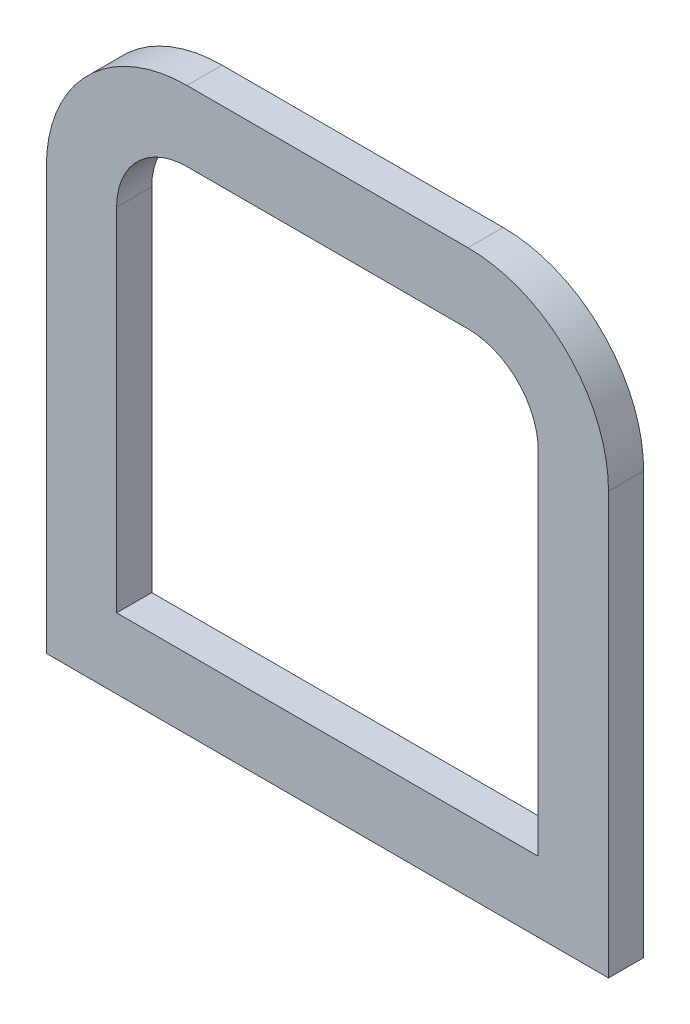
ISO-10303-21;
HEADER;
FILE_DESCRIPTION(('STEP AP214'),'2;1');
FILE_NAME('part.step','',(''),(''),'','','');
FILE_SCHEMA(('AUTOMOTIVE_DESIGN { 1 0 10303 214 1 1 1 1 }'));
ENDSEC;
DATA;
#1=APPLICATION_CONTEXT('core data for automotive mechanical design processes');
#2=APPLICATION_PROTOCOL_DEFINITION('international standard','automotive_design',2000,#1);
#3=PRODUCT_CONTEXT('',#1,'mechanical');
#4=PRODUCT('Part','Part','',(#3));
#5=PRODUCT_RELATED_PRODUCT_CATEGORY('part','',(#4));
#6=PRODUCT_DEFINITION_FORMATION('','',#4);
#7=PRODUCT_DEFINITION_CONTEXT('part definition',#1,'design');
#8=PRODUCT_DEFINITION('design','',#6,#7);
#9=PRODUCT_DEFINITION_SHAPE('','',#8);
#10=(LENGTH_UNIT() NAMED_UNIT(*) SI_UNIT(.MILLI.,.METRE.));
#11=(NAMED_UNIT(*) PLANE_ANGLE_UNIT() SI_UNIT($,.RADIAN.));
#12=(NAMED_UNIT(*) SI_UNIT($,.STERADIAN.) SOLID_ANGLE_UNIT());
#13=UNCERTAINTY_MEASURE_WITH_UNIT(LENGTH_MEASURE(1.E-05),#10,'distance_accuracy_value','');
#14=(GEOMETRIC_REPRESENTATION_CONTEXT(3) GLOBAL_UNCERTAINTY_ASSIGNED_CONTEXT((#13)) GLOBAL_UNIT_ASSIGNED_CONTEXT((#10,
#11,#12)) REPRESENTATION_CONTEXT('',''));
#15=CARTESIAN_POINT('',(0.,0.,0.));
#16=DIRECTION('',(0.,0.,1.));
#17=DIRECTION('',(1.,0.,0.));
#18=AXIS2_PLACEMENT_3D('',#15,#16,#17);
#19=CARTESIAN_POINT('',(-4.,4.,1.));
#20=DIRECTION('',(0.,0.,1.));
#21=DIRECTION('',(1.,0.,0.));
#22=AXIS2_PLACEMENT_3D('',#19,#20,#21);
#23=PLANE('',#22);
#24=CARTESIAN_POINT('',(-4.,4.,1.));
#25=DIRECTION('',(0.,0.,1.));
#26=DIRECTION('',(1.,0.,0.));
#27=AXIS2_PLACEMENT_3D('',#24,#25,#26);
#28=CIRCLE('',#27,4.);
#29=CARTESIAN_POINT('',(-3.99999999999999,8.,1.));
#30=VERTEX_POINT('',#29);
#31=CARTESIAN_POINT('',(-8.,3.99999999999999,1.));
#32=VERTEX_POINT('',#31);
#33=EDGE_CURVE('E204',#30,#32,#28,.T.);
#34=ORIENTED_EDGE('',*,*,#33,.T.);
#35=DIRECTION('',(0.,-1.,0.));
#36=VECTOR('',#35,1.);
#37=CARTESIAN_POINT('',(-8.,3.99999999999999,1.));
#38=LINE('',#37,#36);
#39=CARTESIAN_POINT('',(-8.,-8.,1.));
#40=VERTEX_POINT('',#39);
#41=EDGE_CURVE('E208',#32,#40,#38,.T.);
#42=ORIENTED_EDGE('',*,*,#41,.T.);
#43=DIRECTION('',(1.,0.,0.));
#44=VECTOR('',#43,1.);
#45=CARTESIAN_POINT('',(-8.,-8.,1.));
#46=LINE('',#45,#44);
#47=CARTESIAN_POINT('',(8.,-8.,1.));
#48=VERTEX_POINT('',#47);
#49=EDGE_CURVE('E212',#40,#48,#46,.T.);
#50=ORIENTED_EDGE('',*,*,#49,.T.);
#51=DIRECTION('',(0.,1.,0.));
#52=VECTOR('',#51,1.);
#53=CARTESIAN_POINT('',(8.,3.99999999999997,1.));
#54=LINE('',#53,#52);
#55=CARTESIAN_POINT('',(8.,3.99999999999997,1.));
#56=VERTEX_POINT('',#55);
#57=EDGE_CURVE('E215',#48,#56,#54,.T.);
#58=ORIENTED_EDGE('',*,*,#57,.T.);
#59=CARTESIAN_POINT('',(4.,4.,1.));
#60=DIRECTION('',(0.,0.,1.));
#61=DIRECTION('',(-1.,0.,0.));
#62=AXIS2_PLACEMENT_3D('',#59,#60,#61);
#63=CIRCLE('',#62,4.);
#64=CARTESIAN_POINT('',(3.99999999999998,8.,1.));
#65=VERTEX_POINT('',#64);
#66=EDGE_CURVE('E218',#56,#65,#63,.T.);
#67=ORIENTED_EDGE('',*,*,#66,.T.);
#68=DIRECTION('',(-1.,0.,0.));
#69=VECTOR('',#68,1.);
#70=CARTESIAN_POINT('',(-3.99999999999999,8.,1.));
#71=LINE('',#70,#69);
#72=EDGE_CURVE('E221',#65,#30,#71,.T.);
#73=ORIENTED_EDGE('',*,*,#72,.T.);
#74=EDGE_LOOP('',(#34,#42,#50,#58,#67,#73));
#75=FACE_BOUND('',#74,.T.);
#76=CARTESIAN_POINT('',(4.,4.,1.));
#77=DIRECTION('',(0.,0.,1.));
#78=DIRECTION('',(-1.,0.,0.));
#79=AXIS2_PLACEMENT_3D('',#76,#77,#78);
#80=CIRCLE('',#79,2.);
#81=CARTESIAN_POINT('',(6.,3.99999999999999,1.));
#82=VERTEX_POINT('',#81);
#83=CARTESIAN_POINT('',(3.99999999999998,6.,1.));
#84=VERTEX_POINT('',#83);
#85=EDGE_CURVE('E144',#82,#84,#80,.T.);
#86=ORIENTED_EDGE('',*,*,#85,.F.);
#87=DIRECTION('',(0.,1.,0.));
#88=VECTOR('',#87,1.);
#89=CARTESIAN_POINT('',(6.,3.99999999999999,1.));
#90=LINE('',#89,#88);
#91=CARTESIAN_POINT('',(6.,-6.,1.));
#92=VERTEX_POINT('',#91);
#93=EDGE_CURVE('E135',#92,#82,#90,.T.);
#94=ORIENTED_EDGE('',*,*,#93,.F.);
#95=DIRECTION('',(1.,0.,0.));
#96=VECTOR('',#95,1.);
#97=CARTESIAN_POINT('',(-6.,-6.,1.));
#98=LINE('',#97,#96);
#99=CARTESIAN_POINT('',(-6.,-6.,1.));
#100=VERTEX_POINT('',#99);
#101=EDGE_CURVE('E170',#100,#92,#98,.T.);
#102=ORIENTED_EDGE('',*,*,#101,.F.);
#103=DIRECTION('',(0.,-1.,0.));
#104=VECTOR('',#103,1.);
#105=CARTESIAN_POINT('',(-6.,3.99999999999999,1.));
#106=LINE('',#105,#104);
#107=CARTESIAN_POINT('',(-6.,3.99999999999999,1.));
#108=VERTEX_POINT('',#107);
#109=EDGE_CURVE('E167',#108,#100,#106,.T.);
#110=ORIENTED_EDGE('',*,*,#109,.F.);
#111=CARTESIAN_POINT('',(-4.,4.,1.));
#112=DIRECTION('',(0.,0.,1.));
#113=DIRECTION('',(1.,0.,0.));
#114=AXIS2_PLACEMENT_3D('',#111,#112,#113);
#115=CIRCLE('',#114,2.);
#116=CARTESIAN_POINT('',(-3.99999999999999,6.,1.));
#117=VERTEX_POINT('',#116);
#118=EDGE_CURVE('E162',#117,#108,#115,.T.);
#119=ORIENTED_EDGE('',*,*,#118,.F.);
#120=DIRECTION('',(-1.,0.,0.));
#121=VECTOR('',#120,1.);
#122=CARTESIAN_POINT('',(-3.99999999999999,6.,1.));
#123=LINE('',#122,#121);
#124=EDGE_CURVE('E158',#84,#117,#123,.T.);
#125=ORIENTED_EDGE('',*,*,#124,.F.);
#126=EDGE_LOOP('',(#86,#94,#102,#110,#119,#125));
#127=FACE_BOUND('',#126,.T.);
#128=ADVANCED_FACE('F45',(#75,#127),#23,.T.);
#129=CARTESIAN_POINT('',(-4.,4.,0.));
#130=DIRECTION('',(0.,0.,1.));
#131=DIRECTION('',(1.,0.,0.));
#132=AXIS2_PLACEMENT_3D('',#129,#130,#131);
#133=PLANE('',#132);
#134=CARTESIAN_POINT('',(-4.,4.,0.));
#135=DIRECTION('',(0.,0.,1.));
#136=DIRECTION('',(1.,0.,0.));
#137=AXIS2_PLACEMENT_3D('',#134,#135,#136);
#138=CIRCLE('',#137,4.);
#139=CARTESIAN_POINT('',(-3.99999999999999,8.,0.));
#140=VERTEX_POINT('',#139);
#141=CARTESIAN_POINT('',(-8.,3.99999999999999,0.));
#142=VERTEX_POINT('',#141);
#143=EDGE_CURVE('E153',#140,#142,#138,.T.);
#144=ORIENTED_EDGE('',*,*,#143,.F.);
#145=DIRECTION('',(-1.,0.,0.));
#146=VECTOR('',#145,1.);
#147=CARTESIAN_POINT('',(-3.99999999999999,8.,0.));
#148=LINE('',#147,#146);
#149=CARTESIAN_POINT('',(3.99999999999998,8.,0.));
#150=VERTEX_POINT('',#149);
#151=EDGE_CURVE('E209',#150,#140,#148,.T.);
#152=ORIENTED_EDGE('',*,*,#151,.F.);
#153=CARTESIAN_POINT('',(4.,4.,0.));
#154=DIRECTION('',(0.,0.,1.));
#155=DIRECTION('',(-1.,0.,0.));
#156=AXIS2_PLACEMENT_3D('',#153,#154,#155);
#157=CIRCLE('',#156,4.);
#158=CARTESIAN_POINT('',(8.,3.99999999999997,0.));
#159=VERTEX_POINT('',#158);
#160=EDGE_CURVE('E237',#159,#150,#157,.T.);
#161=ORIENTED_EDGE('',*,*,#160,.F.);
#162=DIRECTION('',(0.,1.,0.));
#163=VECTOR('',#162,1.);
#164=CARTESIAN_POINT('',(8.,3.99999999999997,0.));
#165=LINE('',#164,#163);
#166=CARTESIAN_POINT('',(8.,-8.,0.));
#167=VERTEX_POINT('',#166);
#168=EDGE_CURVE('E234',#167,#159,#165,.T.);
#169=ORIENTED_EDGE('',*,*,#168,.F.);
#170=DIRECTION('',(1.,0.,0.));
#171=VECTOR('',#170,1.);
#172=CARTESIAN_POINT('',(-8.,-8.,0.));
#173=LINE('',#172,#171);
#174=CARTESIAN_POINT('',(-8.,-8.,0.));
#175=VERTEX_POINT('',#174);
#176=EDGE_CURVE('E231',#175,#167,#173,.T.);
#177=ORIENTED_EDGE('',*,*,#176,.F.);
#178=DIRECTION('',(0.,-1.,0.));
#179=VECTOR('',#178,1.);
#180=CARTESIAN_POINT('',(-8.,3.99999999999999,0.));
#181=LINE('',#180,#179);
#182=EDGE_CURVE('E228',#142,#175,#181,.T.);
#183=ORIENTED_EDGE('',*,*,#182,.F.);
#184=EDGE_LOOP('',(#144,#152,#161,#169,#177,#183));
#185=FACE_BOUND('',#184,.T.);
#186=DIRECTION('',(0.,1.,0.));
#187=VECTOR('',#186,1.);
#188=CARTESIAN_POINT('',(6.,3.99999999999999,0.));
#189=LINE('',#188,#187);
#190=CARTESIAN_POINT('',(6.,-6.,0.));
#191=VERTEX_POINT('',#190);
#192=CARTESIAN_POINT('',(6.,3.99999999999999,0.));
#193=VERTEX_POINT('',#192);
#194=EDGE_CURVE('E69',#191,#193,#189,.T.);
#195=ORIENTED_EDGE('',*,*,#194,.T.);
#196=CARTESIAN_POINT('',(4.,4.,0.));
#197=DIRECTION('',(0.,0.,1.));
#198=DIRECTION('',(-1.,0.,0.));
#199=AXIS2_PLACEMENT_3D('',#196,#197,#198);
#200=CIRCLE('',#199,2.);
#201=CARTESIAN_POINT('',(3.99999999999998,6.,0.));
#202=VERTEX_POINT('',#201);
#203=EDGE_CURVE('E151',#193,#202,#200,.T.);
#204=ORIENTED_EDGE('',*,*,#203,.T.);
#205=DIRECTION('',(-1.,0.,0.));
#206=VECTOR('',#205,1.);
#207=CARTESIAN_POINT('',(-3.99999999999999,6.,0.));
#208=LINE('',#207,#206);
#209=CARTESIAN_POINT('',(-3.99999999999999,6.,0.));
#210=VERTEX_POINT('',#209);
#211=EDGE_CURVE('E177',#202,#210,#208,.T.);
#212=ORIENTED_EDGE('',*,*,#211,.T.);
#213=CARTESIAN_POINT('',(-4.,4.,0.));
#214=DIRECTION('',(0.,0.,1.));
#215=DIRECTION('',(1.,0.,0.));
#216=AXIS2_PLACEMENT_3D('',#213,#214,#215);
#217=CIRCLE('',#216,2.);
#218=CARTESIAN_POINT('',(-6.,3.99999999999999,0.));
#219=VERTEX_POINT('',#218);
#220=EDGE_CURVE('E181',#210,#219,#217,.T.);
#221=ORIENTED_EDGE('',*,*,#220,.T.);
#222=DIRECTION('',(0.,-1.,0.));
#223=VECTOR('',#222,1.);
#224=CARTESIAN_POINT('',(-6.,3.99999999999999,0.));
#225=LINE('',#224,#223);
#226=CARTESIAN_POINT('',(-6.,-6.,0.));
#227=VERTEX_POINT('',#226);
#228=EDGE_CURVE('E185',#219,#227,#225,.T.);
#229=ORIENTED_EDGE('',*,*,#228,.T.);
#230=DIRECTION('',(1.,0.,0.));
#231=VECTOR('',#230,1.);
#232=CARTESIAN_POINT('',(-6.,-6.,0.));
#233=LINE('',#232,#231);
#234=EDGE_CURVE('E145',#227,#191,#233,.T.);
#235=ORIENTED_EDGE('',*,*,#234,.T.);
#236=EDGE_LOOP('',(#195,#204,#212,#221,#229,#235));
#237=FACE_BOUND('',#236,.T.);
#238=ADVANCED_FACE('F268',(#185,#237),#133,.F.);
#239=CARTESIAN_POINT('',(-4.,4.,1.));
#240=DIRECTION('',(0.,0.,-1.));
#241=DIRECTION('',(-1.,0.,0.));
#242=AXIS2_PLACEMENT_3D('',#239,#240,#241);
#243=CYLINDRICAL_SURFACE('',#242,4.);
#244=ORIENTED_EDGE('',*,*,#143,.T.);
#245=DIRECTION('',(0.,0.,-1.));
#246=VECTOR('',#245,1.);
#247=CARTESIAN_POINT('',(-8.,3.99999999999999,1.));
#248=LINE('',#247,#246);
#249=EDGE_CURVE('E11',#32,#142,#248,.T.);
#250=ORIENTED_EDGE('',*,*,#249,.F.);
#251=ORIENTED_EDGE('',*,*,#33,.F.);
#252=DIRECTION('',(0.,0.,-1.));
#253=VECTOR('',#252,1.);
#254=CARTESIAN_POINT('',(-3.99999999999999,8.,1.));
#255=LINE('',#254,#253);
#256=EDGE_CURVE('E224',#30,#140,#255,.T.);
#257=ORIENTED_EDGE('',*,*,#256,.T.);
#258=EDGE_LOOP('',(#244,#250,#251,#257));
#259=FACE_BOUND('',#258,.T.);
#260=ADVANCED_FACE('F47',(#259),#243,.T.);
#261=CARTESIAN_POINT('',(-8.,3.99999999999999,1.));
#262=DIRECTION('',(1.,0.,0.));
#263=DIRECTION('',(0.,0.,-1.));
#264=AXIS2_PLACEMENT_3D('',#261,#262,#263);
#265=PLANE('',#264);
#266=ORIENTED_EDGE('',*,*,#182,.T.);
#267=DIRECTION('',(0.,0.,-1.));
#268=VECTOR('',#267,1.);
#269=CARTESIAN_POINT('',(-8.,-8.,1.));
#270=LINE('',#269,#268);
#271=EDGE_CURVE('E54',#40,#175,#270,.T.);
#272=ORIENTED_EDGE('',*,*,#271,.F.);
#273=ORIENTED_EDGE('',*,*,#41,.F.);
#274=ORIENTED_EDGE('',*,*,#249,.T.);
#275=EDGE_LOOP('',(#266,#272,#273,#274));
#276=FACE_BOUND('',#275,.T.);
#277=ADVANCED_FACE('F285',(#276),#265,.F.);
#278=CARTESIAN_POINT('',(-8.,-8.,1.));
#279=DIRECTION('',(0.,1.,0.));
#280=DIRECTION('',(0.,0.,1.));
#281=AXIS2_PLACEMENT_3D('',#278,#279,#280);
#282=PLANE('',#281);
#283=ORIENTED_EDGE('',*,*,#176,.T.);
#284=DIRECTION('',(0.,0.,-1.));
#285=VECTOR('',#284,1.);
#286=CARTESIAN_POINT('',(8.,-8.,1.));
#287=LINE('',#286,#285);
#288=EDGE_CURVE('E253',#48,#167,#287,.T.);
#289=ORIENTED_EDGE('',*,*,#288,.F.);
#290=ORIENTED_EDGE('',*,*,#49,.F.);
#291=ORIENTED_EDGE('',*,*,#271,.T.);
#292=EDGE_LOOP('',(#283,#289,#290,#291));
#293=FACE_BOUND('',#292,.T.);
#294=ADVANCED_FACE('F262',(#293),#282,.F.);
#295=CARTESIAN_POINT('',(8.,3.99999999999997,1.));
#296=DIRECTION('',(-1.,0.,0.));
#297=DIRECTION('',(0.,0.,1.));
#298=AXIS2_PLACEMENT_3D('',#295,#296,#297);
#299=PLANE('',#298);
#300=ORIENTED_EDGE('',*,*,#168,.T.);
#301=DIRECTION('',(0.,0.,-1.));
#302=VECTOR('',#301,1.);
#303=CARTESIAN_POINT('',(8.,3.99999999999997,1.));
#304=LINE('',#303,#302);
#305=EDGE_CURVE('E249',#56,#159,#304,.T.);
#306=ORIENTED_EDGE('',*,*,#305,.F.);
#307=ORIENTED_EDGE('',*,*,#57,.F.);
#308=ORIENTED_EDGE('',*,*,#288,.T.);
#309=EDGE_LOOP('',(#300,#306,#307,#308));
#310=FACE_BOUND('',#309,.T.);
#311=ADVANCED_FACE('F274',(#310),#299,.F.);
#312=CARTESIAN_POINT('',(4.,4.,1.));
#313=DIRECTION('',(0.,0.,-1.));
#314=DIRECTION('',(-1.,0.,0.));
#315=AXIS2_PLACEMENT_3D('',#312,#313,#314);
#316=CYLINDRICAL_SURFACE('',#315,4.);
#317=ORIENTED_EDGE('',*,*,#160,.T.);
#318=DIRECTION('',(0.,0.,-1.));
#319=VECTOR('',#318,1.);
#320=CARTESIAN_POINT('',(3.99999999999998,8.,1.));
#321=LINE('',#320,#319);
#322=EDGE_CURVE('E245',#65,#150,#321,.T.);
#323=ORIENTED_EDGE('',*,*,#322,.F.);
#324=ORIENTED_EDGE('',*,*,#66,.F.);
#325=ORIENTED_EDGE('',*,*,#305,.T.);
#326=EDGE_LOOP('',(#317,#323,#324,#325));
#327=FACE_BOUND('',#326,.T.);
#328=ADVANCED_FACE('F278',(#327),#316,.T.);
#329=CARTESIAN_POINT('',(-3.99999999999999,8.,1.));
#330=DIRECTION('',(0.,-1.,0.));
#331=DIRECTION('',(0.,0.,-1.));
#332=AXIS2_PLACEMENT_3D('',#329,#330,#331);
#333=PLANE('',#332);
#334=ORIENTED_EDGE('',*,*,#151,.T.);
#335=ORIENTED_EDGE('',*,*,#256,.F.);
#336=ORIENTED_EDGE('',*,*,#72,.F.);
#337=ORIENTED_EDGE('',*,*,#322,.T.);
#338=EDGE_LOOP('',(#334,#335,#336,#337));
#339=FACE_BOUND('',#338,.T.);
#340=ADVANCED_FACE('F288',(#339),#333,.F.);
#341=CARTESIAN_POINT('',(6.,3.99999999999999,1.));
#342=DIRECTION('',(-1.,0.,0.));
#343=DIRECTION('',(0.,-1.,0.));
#344=AXIS2_PLACEMENT_3D('',#341,#342,#343);
#345=PLANE('',#344);
#346=ORIENTED_EDGE('',*,*,#194,.F.);
#347=DIRECTION('',(0.,0.,-1.));
#348=VECTOR('',#347,1.);
#349=CARTESIAN_POINT('',(6.,-6.,1.));
#350=LINE('',#349,#348);
#351=EDGE_CURVE('E139',#92,#191,#350,.T.);
#352=ORIENTED_EDGE('',*,*,#351,.F.);
#353=ORIENTED_EDGE('',*,*,#93,.T.);
#354=DIRECTION('',(0.,0.,-1.));
#355=VECTOR('',#354,1.);
#356=CARTESIAN_POINT('',(6.,3.99999999999999,1.));
#357=LINE('',#356,#355);
#358=EDGE_CURVE('E138',#82,#193,#357,.T.);
#359=ORIENTED_EDGE('',*,*,#358,.T.);
#360=EDGE_LOOP('',(#346,#352,#353,#359));
#361=FACE_BOUND('',#360,.T.);
#362=ADVANCED_FACE('F137',(#361),#345,.T.);
#363=CARTESIAN_POINT('',(4.,4.,1.));
#364=DIRECTION('',(0.,0.,-1.));
#365=DIRECTION('',(-1.,0.,0.));
#366=AXIS2_PLACEMENT_3D('',#363,#364,#365);
#367=CYLINDRICAL_SURFACE('',#366,2.);
#368=ORIENTED_EDGE('',*,*,#203,.F.);
#369=ORIENTED_EDGE('',*,*,#358,.F.);
#370=ORIENTED_EDGE('',*,*,#85,.T.);
#371=DIRECTION('',(0.,0.,-1.));
#372=VECTOR('',#371,1.);
#373=CARTESIAN_POINT('',(3.99999999999998,6.,1.));
#374=LINE('',#373,#372);
#375=EDGE_CURVE('E154',#84,#202,#374,.T.);
#376=ORIENTED_EDGE('',*,*,#375,.T.);
#377=EDGE_LOOP('',(#368,#369,#370,#376));
#378=FACE_BOUND('',#377,.T.);
#379=ADVANCED_FACE('F148',(#378),#367,.F.);
#380=CARTESIAN_POINT('',(-3.99999999999999,6.,1.));
#381=DIRECTION('',(0.,-1.,0.));
#382=DIRECTION('',(0.,0.,-1.));
#383=AXIS2_PLACEMENT_3D('',#380,#381,#382);
#384=PLANE('',#383);
#385=ORIENTED_EDGE('',*,*,#211,.F.);
#386=ORIENTED_EDGE('',*,*,#375,.F.);
#387=ORIENTED_EDGE('',*,*,#124,.T.);
#388=DIRECTION('',(0.,0.,-1.));
#389=VECTOR('',#388,1.);
#390=CARTESIAN_POINT('',(-3.99999999999999,6.,1.));
#391=LINE('',#390,#389);
#392=EDGE_CURVE('E199',#117,#210,#391,.T.);
#393=ORIENTED_EDGE('',*,*,#392,.T.);
#394=EDGE_LOOP('',(#385,#386,#387,#393));
#395=FACE_BOUND('',#394,.T.);
#396=ADVANCED_FACE('F306',(#395),#384,.T.);
#397=CARTESIAN_POINT('',(-4.,4.,1.));
#398=DIRECTION('',(0.,0.,-1.));
#399=DIRECTION('',(-1.,0.,0.));
#400=AXIS2_PLACEMENT_3D('',#397,#398,#399);
#401=CYLINDRICAL_SURFACE('',#400,2.);
#402=ORIENTED_EDGE('',*,*,#220,.F.);
#403=ORIENTED_EDGE('',*,*,#392,.F.);
#404=ORIENTED_EDGE('',*,*,#118,.T.);
#405=DIRECTION('',(0.,0.,-1.));
#406=VECTOR('',#405,1.);
#407=CARTESIAN_POINT('',(-6.,3.99999999999999,1.));
#408=LINE('',#407,#406);
#409=EDGE_CURVE('E196',#108,#219,#408,.T.);
#410=ORIENTED_EDGE('',*,*,#409,.T.);
#411=EDGE_LOOP('',(#402,#403,#404,#410));
#412=FACE_BOUND('',#411,.T.);
#413=ADVANCED_FACE('F309',(#412),#401,.F.);
#414=CARTESIAN_POINT('',(-6.,3.99999999999999,1.));
#415=DIRECTION('',(1.,0.,0.));
#416=DIRECTION('',(0.,1.,0.));
#417=AXIS2_PLACEMENT_3D('',#414,#415,#416);
#418=PLANE('',#417);
#419=ORIENTED_EDGE('',*,*,#228,.F.);
#420=ORIENTED_EDGE('',*,*,#409,.F.);
#421=ORIENTED_EDGE('',*,*,#109,.T.);
#422=DIRECTION('',(0.,0.,-1.));
#423=VECTOR('',#422,1.);
#424=CARTESIAN_POINT('',(-6.,-6.,1.));
#425=LINE('',#424,#423);
#426=EDGE_CURVE('E61',#100,#227,#425,.T.);
#427=ORIENTED_EDGE('',*,*,#426,.T.);
#428=EDGE_LOOP('',(#419,#420,#421,#427));
#429=FACE_BOUND('',#428,.T.);
#430=ADVANCED_FACE('F313',(#429),#418,.T.);
#431=CARTESIAN_POINT('',(-6.,-6.,1.));
#432=DIRECTION('',(0.,1.,0.));
#433=DIRECTION('',(0.,0.,1.));
#434=AXIS2_PLACEMENT_3D('',#431,#432,#433);
#435=PLANE('',#434);
#436=ORIENTED_EDGE('',*,*,#234,.F.);
#437=ORIENTED_EDGE('',*,*,#426,.F.);
#438=ORIENTED_EDGE('',*,*,#101,.T.);
#439=ORIENTED_EDGE('',*,*,#351,.T.);
#440=EDGE_LOOP('',(#436,#437,#438,#439));
#441=FACE_BOUND('',#440,.T.);
#442=ADVANCED_FACE('F317',(#441),#435,.T.);
#443=CLOSED_SHELL('',(#128,#238,#260,#277,#294,#311,#328,#340,#362,#379,#396,#413,#430,#442));
#444=MANIFOLD_SOLID_BREP('B2',#443);
#445=ADVANCED_BREP_SHAPE_REPRESENTATION('',(#18,#444),#14);
#446=SHAPE_DEFINITION_REPRESENTATION(#9,#445);
ENDSEC;
END-ISO-10303-21;
